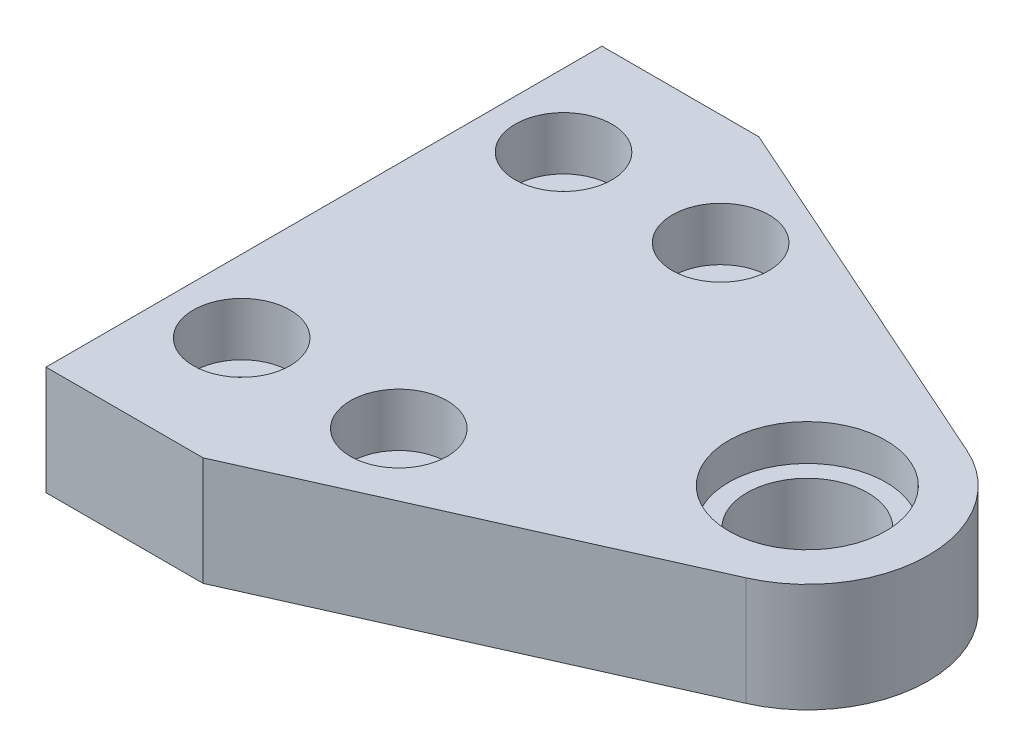
ISO-10303-21;
HEADER;
FILE_DESCRIPTION(('STEP AP214'),'2;1');
FILE_NAME('part.step','',(''),(''),'','','');
FILE_SCHEMA(('AUTOMOTIVE_DESIGN { 1 0 10303 214 1 1 1 1 }'));
ENDSEC;
DATA;
#1=APPLICATION_CONTEXT('core data for automotive mechanical design processes');
#2=APPLICATION_PROTOCOL_DEFINITION('international standard','automotive_design',2000,#1);
#3=PRODUCT_CONTEXT('',#1,'mechanical');
#4=PRODUCT('Part','Part','',(#3));
#5=PRODUCT_RELATED_PRODUCT_CATEGORY('part','',(#4));
#6=PRODUCT_DEFINITION_FORMATION('','',#4);
#7=PRODUCT_DEFINITION_CONTEXT('part definition',#1,'design');
#8=PRODUCT_DEFINITION('design','',#6,#7);
#9=PRODUCT_DEFINITION_SHAPE('','',#8);
#10=(LENGTH_UNIT() NAMED_UNIT(*) SI_UNIT(.MILLI.,.METRE.));
#11=(NAMED_UNIT(*) PLANE_ANGLE_UNIT() SI_UNIT($,.RADIAN.));
#12=(NAMED_UNIT(*) SI_UNIT($,.STERADIAN.) SOLID_ANGLE_UNIT());
#13=UNCERTAINTY_MEASURE_WITH_UNIT(LENGTH_MEASURE(1.E-05),#10,'distance_accuracy_value','');
#14=(GEOMETRIC_REPRESENTATION_CONTEXT(3) GLOBAL_UNCERTAINTY_ASSIGNED_CONTEXT((#13)) GLOBAL_UNIT_ASSIGNED_CONTEXT((#10,
#11,#12)) REPRESENTATION_CONTEXT('',''));
#15=CARTESIAN_POINT('',(0.,0.,0.));
#16=DIRECTION('',(0.,0.,1.));
#17=DIRECTION('',(1.,0.,0.));
#18=AXIS2_PLACEMENT_3D('',#15,#16,#17);
#19=CARTESIAN_POINT('',(40.,0.,0.));
#20=DIRECTION('',(0.,1.,0.));
#21=DIRECTION('',(0.,0.,1.));
#22=AXIS2_PLACEMENT_3D('',#19,#20,#21);
#23=PLANE('',#22);
#24=CARTESIAN_POINT('',(40.,0.,0.));
#25=DIRECTION('',(0.,1.,0.));
#26=DIRECTION('',(0.,0.,1.));
#27=AXIS2_PLACEMENT_3D('',#24,#25,#26);
#28=CIRCLE('',#27,5.);
#29=CARTESIAN_POINT('',(40.,0.,5.));
#30=VERTEX_POINT('',#29);
#31=EDGE_CURVE('E43',#30,#30,#28,.T.);
#32=ORIENTED_EDGE('',*,*,#31,.T.);
#33=EDGE_LOOP('',(#32));
#34=FACE_BOUND('',#33,.T.);
#35=CARTESIAN_POINT('',(6.,0.,-13.827116768124));
#36=DIRECTION('',(0.,1.,0.));
#37=DIRECTION('',(0.,0.,1.));
#38=AXIS2_PLACEMENT_3D('',#35,#36,#37);
#39=CIRCLE('',#38,2.25);
#40=CARTESIAN_POINT('',(6.,0.,-11.577116768124));
#41=VERTEX_POINT('',#40);
#42=EDGE_CURVE('E296',#41,#41,#39,.T.);
#43=ORIENTED_EDGE('',*,*,#42,.T.);
#44=EDGE_LOOP('',(#43));
#45=FACE_BOUND('',#44,.T.);
#46=CARTESIAN_POINT('',(19.,0.,-13.827116768124));
#47=DIRECTION('',(0.,1.,0.));
#48=DIRECTION('',(0.,0.,1.));
#49=AXIS2_PLACEMENT_3D('',#46,#47,#48);
#50=CIRCLE('',#49,2.25);
#51=CARTESIAN_POINT('',(19.,0.,-11.577116768124));
#52=VERTEX_POINT('',#51);
#53=EDGE_CURVE('E280',#52,#52,#50,.T.);
#54=ORIENTED_EDGE('',*,*,#53,.T.);
#55=EDGE_LOOP('',(#54));
#56=FACE_BOUND('',#55,.T.);
#57=CARTESIAN_POINT('',(6.,0.,12.807083563918));
#58=DIRECTION('',(0.,1.,0.));
#59=DIRECTION('',(0.,0.,1.));
#60=AXIS2_PLACEMENT_3D('',#57,#58,#59);
#61=CIRCLE('',#60,2.25);
#62=CARTESIAN_POINT('',(6.,0.,15.057083563918));
#63=VERTEX_POINT('',#62);
#64=EDGE_CURVE('E264',#63,#63,#61,.T.);
#65=ORIENTED_EDGE('',*,*,#64,.T.);
#66=EDGE_LOOP('',(#65));
#67=FACE_BOUND('',#66,.T.);
#68=CARTESIAN_POINT('',(19.,0.,12.807083563918));
#69=DIRECTION('',(0.,1.,0.));
#70=DIRECTION('',(0.,0.,1.));
#71=AXIS2_PLACEMENT_3D('',#68,#69,#70);
#72=CIRCLE('',#71,2.25);
#73=CARTESIAN_POINT('',(19.,0.,15.057083563918));
#74=VERTEX_POINT('',#73);
#75=EDGE_CURVE('E245',#74,#74,#72,.T.);
#76=ORIENTED_EDGE('',*,*,#75,.T.);
#77=EDGE_LOOP('',(#76));
#78=FACE_BOUND('',#77,.T.);
#79=DIRECTION('',(-1.,0.,0.));
#80=VECTOR('',#79,1.);
#81=CARTESIAN_POINT('',(0.,0.,5.));
#82=LINE('',#81,#80);
#83=CARTESIAN_POINT('',(24.,0.,5.));
#84=VERTEX_POINT('',#83);
#85=CARTESIAN_POINT('',(0.,0.,5.));
#86=VERTEX_POINT('',#85);
#87=EDGE_CURVE('E56',#84,#86,#82,.T.);
#88=ORIENTED_EDGE('',*,*,#87,.F.);
#89=DIRECTION('',(0.,0.,1.));
#90=VECTOR('',#89,1.);
#91=CARTESIAN_POINT('',(24.,0.,-5.));
#92=LINE('',#91,#90);
#93=CARTESIAN_POINT('',(24.,0.,-5.));
#94=VERTEX_POINT('',#93);
#95=EDGE_CURVE('E240',#94,#84,#92,.T.);
#96=ORIENTED_EDGE('',*,*,#95,.F.);
#97=DIRECTION('',(1.,0.,0.));
#98=VECTOR('',#97,1.);
#99=CARTESIAN_POINT('',(0.,0.,-5.));
#100=LINE('',#99,#98);
#101=CARTESIAN_POINT('',(0.,0.,-5.));
#102=VERTEX_POINT('',#101);
#103=EDGE_CURVE('E243',#102,#94,#100,.T.);
#104=ORIENTED_EDGE('',*,*,#103,.F.);
#105=DIRECTION('',(0.,0.,1.));
#106=VECTOR('',#105,1.);
#107=CARTESIAN_POINT('',(0.,0.,0.));
#108=LINE('',#107,#106);
#109=CARTESIAN_POINT('',(0.,0.,-23.));
#110=VERTEX_POINT('',#109);
#111=EDGE_CURVE('E143',#110,#102,#108,.T.);
#112=ORIENTED_EDGE('',*,*,#111,.F.);
#113=DIRECTION('',(-1.,0.,0.));
#114=VECTOR('',#113,1.);
#115=CARTESIAN_POINT('',(0.,0.,-23.));
#116=LINE('',#115,#114);
#117=CARTESIAN_POINT('',(13.,0.,-23.));
#118=VERTEX_POINT('',#117);
#119=EDGE_CURVE('E184',#118,#110,#116,.T.);
#120=ORIENTED_EDGE('',*,*,#119,.F.);
#121=DIRECTION('',(-0.91319059973559,0.,-0.407532733108095));
#122=VECTOR('',#121,1.);
#123=CARTESIAN_POINT('',(13.,0.,-23.));
#124=LINE('',#123,#122);
#125=CARTESIAN_POINT('',(44.0753273310809,0.,-9.1319059973559));
#126=VERTEX_POINT('',#125);
#127=EDGE_CURVE('E181',#126,#118,#124,.T.);
#128=ORIENTED_EDGE('',*,*,#127,.F.);
#129=CARTESIAN_POINT('',(40.,0.,0.));
#130=DIRECTION('',(0.,1.,0.));
#131=DIRECTION('',(0.,0.,1.));
#132=AXIS2_PLACEMENT_3D('',#129,#130,#131);
#133=CIRCLE('',#132,10.);
#134=CARTESIAN_POINT('',(44.0753273310809,0.,9.1319059973559));
#135=VERTEX_POINT('',#134);
#136=EDGE_CURVE('E178',#135,#126,#133,.T.);
#137=ORIENTED_EDGE('',*,*,#136,.F.);
#138=DIRECTION('',(0.91319059973559,0.,-0.407532733108095));
#139=VECTOR('',#138,1.);
#140=CARTESIAN_POINT('',(44.0753273310809,0.,9.1319059973559));
#141=LINE('',#140,#139);
#142=CARTESIAN_POINT('',(13.,0.,23.));
#143=VERTEX_POINT('',#142);
#144=EDGE_CURVE('E149',#143,#135,#141,.T.);
#145=ORIENTED_EDGE('',*,*,#144,.F.);
#146=DIRECTION('',(1.,0.,0.));
#147=VECTOR('',#146,1.);
#148=CARTESIAN_POINT('',(13.,0.,23.));
#149=LINE('',#148,#147);
#150=CARTESIAN_POINT('',(0.,0.,23.));
#151=VERTEX_POINT('',#150);
#152=EDGE_CURVE('E145',#151,#143,#149,.T.);
#153=ORIENTED_EDGE('',*,*,#152,.F.);
#154=EDGE_CURVE('E61',#86,#151,#108,.T.);
#155=ORIENTED_EDGE('',*,*,#154,.F.);
#156=EDGE_LOOP('',(#88,#96,#104,#112,#120,#128,#137,#145,#153,#155));
#157=FACE_BOUND('',#156,.T.);
#158=ADVANCED_FACE('F39',(#34,#45,#56,#67,#78,#157),#23,.F.);
#159=CARTESIAN_POINT('',(13.,9.,23.));
#160=DIRECTION('',(0.,0.,-1.));
#161=DIRECTION('',(-1.,0.,0.));
#162=AXIS2_PLACEMENT_3D('',#159,#160,#161);
#163=PLANE('',#162);
#164=ORIENTED_EDGE('',*,*,#152,.T.);
#165=DIRECTION('',(0.,-1.,0.));
#166=VECTOR('',#165,1.);
#167=CARTESIAN_POINT('',(13.,9.,23.));
#168=LINE('',#167,#166);
#169=CARTESIAN_POINT('',(13.,9.,23.));
#170=VERTEX_POINT('',#169);
#171=EDGE_CURVE('E49',#170,#143,#168,.T.);
#172=ORIENTED_EDGE('',*,*,#171,.F.);
#173=DIRECTION('',(1.,0.,0.));
#174=VECTOR('',#173,1.);
#175=CARTESIAN_POINT('',(13.,9.,23.));
#176=LINE('',#175,#174);
#177=CARTESIAN_POINT('',(0.,9.,23.));
#178=VERTEX_POINT('',#177);
#179=EDGE_CURVE('E159',#178,#170,#176,.T.);
#180=ORIENTED_EDGE('',*,*,#179,.F.);
#181=DIRECTION('',(0.,-1.,0.));
#182=VECTOR('',#181,1.);
#183=CARTESIAN_POINT('',(0.,9.,23.));
#184=LINE('',#183,#182);
#185=EDGE_CURVE('E11',#178,#151,#184,.T.);
#186=ORIENTED_EDGE('',*,*,#185,.T.);
#187=EDGE_LOOP('',(#164,#172,#180,#186));
#188=FACE_BOUND('',#187,.T.);
#189=ADVANCED_FACE('F41',(#188),#163,.F.);
#190=CARTESIAN_POINT('',(44.0753273310809,9.,9.1319059973559));
#191=DIRECTION('',(-0.407532733108095,0.,-0.91319059973559));
#192=DIRECTION('',(-0.91319059973559,0.,0.407532733108095));
#193=AXIS2_PLACEMENT_3D('',#190,#191,#192);
#194=PLANE('',#193);
#195=ORIENTED_EDGE('',*,*,#144,.T.);
#196=DIRECTION('',(0.,-1.,0.));
#197=VECTOR('',#196,1.);
#198=CARTESIAN_POINT('',(44.0753273310809,9.,9.1319059973559));
#199=LINE('',#198,#197);
#200=CARTESIAN_POINT('',(44.0753273310809,9.,9.1319059973559));
#201=VERTEX_POINT('',#200);
#202=EDGE_CURVE('E199',#201,#135,#199,.T.);
#203=ORIENTED_EDGE('',*,*,#202,.F.);
#204=DIRECTION('',(0.91319059973559,0.,-0.407532733108095));
#205=VECTOR('',#204,1.);
#206=CARTESIAN_POINT('',(44.0753273310809,9.,9.1319059973559));
#207=LINE('',#206,#205);
#208=EDGE_CURVE('E162',#170,#201,#207,.T.);
#209=ORIENTED_EDGE('',*,*,#208,.F.);
#210=ORIENTED_EDGE('',*,*,#171,.T.);
#211=EDGE_LOOP('',(#195,#203,#209,#210));
#212=FACE_BOUND('',#211,.T.);
#213=ADVANCED_FACE('F209',(#212),#194,.F.);
#214=CARTESIAN_POINT('',(40.,9.,0.));
#215=DIRECTION('',(0.,-1.,0.));
#216=DIRECTION('',(0.,0.,-1.));
#217=AXIS2_PLACEMENT_3D('',#214,#215,#216);
#218=CYLINDRICAL_SURFACE('',#217,10.);
#219=ORIENTED_EDGE('',*,*,#136,.T.);
#220=DIRECTION('',(0.,-1.,0.));
#221=VECTOR('',#220,1.);
#222=CARTESIAN_POINT('',(44.0753273310809,9.,-9.1319059973559));
#223=LINE('',#222,#221);
#224=CARTESIAN_POINT('',(44.0753273310809,9.,-9.1319059973559));
#225=VERTEX_POINT('',#224);
#226=EDGE_CURVE('E195',#225,#126,#223,.T.);
#227=ORIENTED_EDGE('',*,*,#226,.F.);
#228=CARTESIAN_POINT('',(40.,9.,0.));
#229=DIRECTION('',(0.,1.,0.));
#230=DIRECTION('',(0.,0.,1.));
#231=AXIS2_PLACEMENT_3D('',#228,#229,#230);
#232=CIRCLE('',#231,10.);
#233=EDGE_CURVE('E165',#201,#225,#232,.T.);
#234=ORIENTED_EDGE('',*,*,#233,.F.);
#235=ORIENTED_EDGE('',*,*,#202,.T.);
#236=EDGE_LOOP('',(#219,#227,#234,#235));
#237=FACE_BOUND('',#236,.T.);
#238=ADVANCED_FACE('F217',(#237),#218,.T.);
#239=CARTESIAN_POINT('',(13.,9.,-23.));
#240=DIRECTION('',(-0.407532733108095,0.,0.91319059973559));
#241=DIRECTION('',(0.91319059973559,0.,0.407532733108095));
#242=AXIS2_PLACEMENT_3D('',#239,#240,#241);
#243=PLANE('',#242);
#244=ORIENTED_EDGE('',*,*,#127,.T.);
#245=DIRECTION('',(0.,-1.,0.));
#246=VECTOR('',#245,1.);
#247=CARTESIAN_POINT('',(13.,9.,-23.));
#248=LINE('',#247,#246);
#249=CARTESIAN_POINT('',(13.,9.,-23.));
#250=VERTEX_POINT('',#249);
#251=EDGE_CURVE('E191',#250,#118,#248,.T.);
#252=ORIENTED_EDGE('',*,*,#251,.F.);
#253=DIRECTION('',(-0.91319059973559,0.,-0.407532733108095));
#254=VECTOR('',#253,1.);
#255=CARTESIAN_POINT('',(13.,9.,-23.));
#256=LINE('',#255,#254);
#257=EDGE_CURVE('E168',#225,#250,#256,.T.);
#258=ORIENTED_EDGE('',*,*,#257,.F.);
#259=ORIENTED_EDGE('',*,*,#226,.T.);
#260=EDGE_LOOP('',(#244,#252,#258,#259));
#261=FACE_BOUND('',#260,.T.);
#262=ADVANCED_FACE('F221',(#261),#243,.F.);
#263=CARTESIAN_POINT('',(0.,9.,-23.));
#264=DIRECTION('',(0.,0.,1.));
#265=DIRECTION('',(1.,0.,0.));
#266=AXIS2_PLACEMENT_3D('',#263,#264,#265);
#267=PLANE('',#266);
#268=ORIENTED_EDGE('',*,*,#119,.T.);
#269=DIRECTION('',(0.,-1.,0.));
#270=VECTOR('',#269,1.);
#271=CARTESIAN_POINT('',(0.,9.,-23.));
#272=LINE('',#271,#270);
#273=CARTESIAN_POINT('',(0.,9.,-23.));
#274=VERTEX_POINT('',#273);
#275=EDGE_CURVE('E174',#274,#110,#272,.T.);
#276=ORIENTED_EDGE('',*,*,#275,.F.);
#277=DIRECTION('',(-1.,0.,0.));
#278=VECTOR('',#277,1.);
#279=CARTESIAN_POINT('',(0.,9.,-23.));
#280=LINE('',#279,#278);
#281=EDGE_CURVE('E171',#250,#274,#280,.T.);
#282=ORIENTED_EDGE('',*,*,#281,.F.);
#283=ORIENTED_EDGE('',*,*,#251,.T.);
#284=EDGE_LOOP('',(#268,#276,#282,#283));
#285=FACE_BOUND('',#284,.T.);
#286=ADVANCED_FACE('F367',(#285),#267,.F.);
#287=CARTESIAN_POINT('',(0.,9.,0.));
#288=DIRECTION('',(1.,0.,0.));
#289=DIRECTION('',(0.,0.,-1.));
#290=AXIS2_PLACEMENT_3D('',#287,#288,#289);
#291=PLANE('',#290);
#292=ORIENTED_EDGE('',*,*,#111,.T.);
#293=DIRECTION('',(0.,1.,0.));
#294=VECTOR('',#293,1.);
#295=CARTESIAN_POINT('',(0.,-3.,-5.));
#296=LINE('',#295,#294);
#297=CARTESIAN_POINT('',(0.,-3.,-5.));
#298=VERTEX_POINT('',#297);
#299=EDGE_CURVE('E121',#298,#102,#296,.T.);
#300=ORIENTED_EDGE('',*,*,#299,.F.);
#301=DIRECTION('',(0.,0.,-1.));
#302=VECTOR('',#301,1.);
#303=CARTESIAN_POINT('',(0.,-3.,-5.));
#304=LINE('',#303,#302);
#305=CARTESIAN_POINT('',(0.,-3.,5.));
#306=VERTEX_POINT('',#305);
#307=EDGE_CURVE('E128',#306,#298,#304,.T.);
#308=ORIENTED_EDGE('',*,*,#307,.F.);
#309=DIRECTION('',(0.,1.,0.));
#310=VECTOR('',#309,1.);
#311=CARTESIAN_POINT('',(0.,-3.,5.));
#312=LINE('',#311,#310);
#313=EDGE_CURVE('E228',#306,#86,#312,.T.);
#314=ORIENTED_EDGE('',*,*,#313,.T.);
#315=ORIENTED_EDGE('',*,*,#154,.T.);
#316=ORIENTED_EDGE('',*,*,#185,.F.);
#317=DIRECTION('',(0.,0.,1.));
#318=VECTOR('',#317,1.);
#319=CARTESIAN_POINT('',(0.,9.,23.));
#320=LINE('',#319,#318);
#321=EDGE_CURVE('E155',#274,#178,#320,.T.);
#322=ORIENTED_EDGE('',*,*,#321,.F.);
#323=ORIENTED_EDGE('',*,*,#275,.T.);
#324=EDGE_LOOP('',(#292,#300,#308,#314,#315,#316,#322,#323));
#325=FACE_BOUND('',#324,.T.);
#326=ADVANCED_FACE('F140',(#325),#291,.F.);
#327=CARTESIAN_POINT('',(40.,9.,0.));
#328=DIRECTION('',(0.,1.,0.));
#329=DIRECTION('',(0.,0.,1.));
#330=AXIS2_PLACEMENT_3D('',#327,#328,#329);
#331=PLANE('',#330);
#332=CARTESIAN_POINT('',(40.,9.,0.));
#333=DIRECTION('',(0.,1.,0.));
#334=DIRECTION('',(0.,0.,1.));
#335=AXIS2_PLACEMENT_3D('',#332,#333,#334);
#336=CIRCLE('',#335,6.5);
#337=CARTESIAN_POINT('',(40.,9.,6.5));
#338=VERTEX_POINT('',#337);
#339=EDGE_CURVE('E320',#338,#338,#336,.T.);
#340=ORIENTED_EDGE('',*,*,#339,.F.);
#341=EDGE_LOOP('',(#340));
#342=FACE_BOUND('',#341,.T.);
#343=CARTESIAN_POINT('',(6.,9.,-13.827116768124));
#344=DIRECTION('',(0.,1.,0.));
#345=DIRECTION('',(0.,0.,1.));
#346=AXIS2_PLACEMENT_3D('',#343,#344,#345);
#347=CIRCLE('',#346,3.99999999999999);
#348=CARTESIAN_POINT('',(6.,9.,-9.827116768124));
#349=VERTEX_POINT('',#348);
#350=EDGE_CURVE('E308',#349,#349,#347,.T.);
#351=ORIENTED_EDGE('',*,*,#350,.F.);
#352=EDGE_LOOP('',(#351));
#353=FACE_BOUND('',#352,.T.);
#354=CARTESIAN_POINT('',(19.,9.,-13.827116768124));
#355=DIRECTION('',(0.,1.,0.));
#356=DIRECTION('',(0.,0.,1.));
#357=AXIS2_PLACEMENT_3D('',#354,#355,#356);
#358=CIRCLE('',#357,3.99999999999999);
#359=CARTESIAN_POINT('',(19.,9.,-9.827116768124));
#360=VERTEX_POINT('',#359);
#361=EDGE_CURVE('E292',#360,#360,#358,.T.);
#362=ORIENTED_EDGE('',*,*,#361,.F.);
#363=EDGE_LOOP('',(#362));
#364=FACE_BOUND('',#363,.T.);
#365=CARTESIAN_POINT('',(6.,9.,12.807083563918));
#366=DIRECTION('',(0.,1.,0.));
#367=DIRECTION('',(0.,0.,1.));
#368=AXIS2_PLACEMENT_3D('',#365,#366,#367);
#369=CIRCLE('',#368,3.99999999999999);
#370=CARTESIAN_POINT('',(6.,9.,16.807083563918));
#371=VERTEX_POINT('',#370);
#372=EDGE_CURVE('E276',#371,#371,#369,.T.);
#373=ORIENTED_EDGE('',*,*,#372,.F.);
#374=EDGE_LOOP('',(#373));
#375=FACE_BOUND('',#374,.T.);
#376=CARTESIAN_POINT('',(19.,9.,12.807083563918));
#377=DIRECTION('',(0.,1.,0.));
#378=DIRECTION('',(0.,0.,1.));
#379=AXIS2_PLACEMENT_3D('',#376,#377,#378);
#380=CIRCLE('',#379,3.99999999999999);
#381=CARTESIAN_POINT('',(19.,9.,16.807083563918));
#382=VERTEX_POINT('',#381);
#383=EDGE_CURVE('E260',#382,#382,#380,.T.);
#384=ORIENTED_EDGE('',*,*,#383,.F.);
#385=EDGE_LOOP('',(#384));
#386=FACE_BOUND('',#385,.T.);
#387=ORIENTED_EDGE('',*,*,#321,.T.);
#388=ORIENTED_EDGE('',*,*,#179,.T.);
#389=ORIENTED_EDGE('',*,*,#208,.T.);
#390=ORIENTED_EDGE('',*,*,#233,.T.);
#391=ORIENTED_EDGE('',*,*,#257,.T.);
#392=ORIENTED_EDGE('',*,*,#281,.T.);
#393=EDGE_LOOP('',(#387,#388,#389,#390,#391,#392));
#394=FACE_BOUND('',#393,.T.);
#395=ADVANCED_FACE('F225',(#342,#353,#364,#375,#386,#394),#331,.T.);
#396=CARTESIAN_POINT('',(0.,-3.,-5.));
#397=DIRECTION('',(0.,0.,1.));
#398=DIRECTION('',(1.,0.,0.));
#399=AXIS2_PLACEMENT_3D('',#396,#397,#398);
#400=PLANE('',#399);
#401=ORIENTED_EDGE('',*,*,#103,.T.);
#402=DIRECTION('',(0.,1.,0.));
#403=VECTOR('',#402,1.);
#404=CARTESIAN_POINT('',(24.,-3.,-5.));
#405=LINE('',#404,#403);
#406=CARTESIAN_POINT('',(24.,-3.,-5.));
#407=VERTEX_POINT('',#406);
#408=EDGE_CURVE('E123',#407,#94,#405,.T.);
#409=ORIENTED_EDGE('',*,*,#408,.F.);
#410=DIRECTION('',(1.,0.,0.));
#411=VECTOR('',#410,1.);
#412=CARTESIAN_POINT('',(0.,-3.,-5.));
#413=LINE('',#412,#411);
#414=EDGE_CURVE('E116',#298,#407,#413,.T.);
#415=ORIENTED_EDGE('',*,*,#414,.F.);
#416=ORIENTED_EDGE('',*,*,#299,.T.);
#417=EDGE_LOOP('',(#401,#409,#415,#416));
#418=FACE_BOUND('',#417,.T.);
#419=ADVANCED_FACE('F119',(#418),#400,.F.);
#420=CARTESIAN_POINT('',(24.,-3.,-5.));
#421=DIRECTION('',(-1.,0.,0.));
#422=DIRECTION('',(0.,0.,1.));
#423=AXIS2_PLACEMENT_3D('',#420,#421,#422);
#424=PLANE('',#423);
#425=ORIENTED_EDGE('',*,*,#95,.T.);
#426=DIRECTION('',(0.,1.,0.));
#427=VECTOR('',#426,1.);
#428=CARTESIAN_POINT('',(24.,-3.,5.));
#429=LINE('',#428,#427);
#430=CARTESIAN_POINT('',(24.,-3.,5.));
#431=VERTEX_POINT('',#430);
#432=EDGE_CURVE('E151',#431,#84,#429,.T.);
#433=ORIENTED_EDGE('',*,*,#432,.F.);
#434=DIRECTION('',(0.,0.,1.));
#435=VECTOR('',#434,1.);
#436=CARTESIAN_POINT('',(24.,-3.,-5.));
#437=LINE('',#436,#435);
#438=EDGE_CURVE('E127',#407,#431,#437,.T.);
#439=ORIENTED_EDGE('',*,*,#438,.F.);
#440=ORIENTED_EDGE('',*,*,#408,.T.);
#441=EDGE_LOOP('',(#425,#433,#439,#440));
#442=FACE_BOUND('',#441,.T.);
#443=ADVANCED_FACE('F406',(#442),#424,.F.);
#444=CARTESIAN_POINT('',(0.,-3.,5.));
#445=DIRECTION('',(0.,0.,-1.));
#446=DIRECTION('',(-1.,0.,0.));
#447=AXIS2_PLACEMENT_3D('',#444,#445,#446);
#448=PLANE('',#447);
#449=ORIENTED_EDGE('',*,*,#87,.T.);
#450=ORIENTED_EDGE('',*,*,#313,.F.);
#451=DIRECTION('',(-1.,0.,0.));
#452=VECTOR('',#451,1.);
#453=CARTESIAN_POINT('',(0.,-3.,5.));
#454=LINE('',#453,#452);
#455=EDGE_CURVE('E133',#431,#306,#454,.T.);
#456=ORIENTED_EDGE('',*,*,#455,.F.);
#457=ORIENTED_EDGE('',*,*,#432,.T.);
#458=EDGE_LOOP('',(#449,#450,#456,#457));
#459=FACE_BOUND('',#458,.T.);
#460=ADVANCED_FACE('F412',(#459),#448,.F.);
#461=CARTESIAN_POINT('',(0.,-3.,0.));
#462=DIRECTION('',(0.,1.,0.));
#463=DIRECTION('',(0.,0.,1.));
#464=AXIS2_PLACEMENT_3D('',#461,#462,#463);
#465=PLANE('',#464);
#466=ORIENTED_EDGE('',*,*,#307,.T.);
#467=ORIENTED_EDGE('',*,*,#414,.T.);
#468=ORIENTED_EDGE('',*,*,#438,.T.);
#469=ORIENTED_EDGE('',*,*,#455,.T.);
#470=EDGE_LOOP('',(#466,#467,#468,#469));
#471=FACE_BOUND('',#470,.T.);
#472=ADVANCED_FACE('F131',(#471),#465,.F.);
#473=CARTESIAN_POINT('',(19.,9.,12.807083563918));
#474=DIRECTION('',(0.,1.,0.));
#475=DIRECTION('',(0.,0.,1.));
#476=AXIS2_PLACEMENT_3D('',#473,#474,#475);
#477=CYLINDRICAL_SURFACE('',#476,2.25);
#478=ORIENTED_EDGE('',*,*,#75,.F.);
#479=EDGE_LOOP('',(#478));
#480=FACE_BOUND('',#479,.T.);
#481=CARTESIAN_POINT('',(19.,4.6,12.807083563918));
#482=DIRECTION('',(0.,1.,0.));
#483=DIRECTION('',(0.,0.,1.));
#484=AXIS2_PLACEMENT_3D('',#481,#482,#483);
#485=CIRCLE('',#484,2.25);
#486=CARTESIAN_POINT('',(19.,4.6,15.057083563918));
#487=VERTEX_POINT('',#486);
#488=EDGE_CURVE('E252',#487,#487,#485,.T.);
#489=ORIENTED_EDGE('',*,*,#488,.T.);
#490=EDGE_LOOP('',(#489));
#491=FACE_BOUND('',#490,.T.);
#492=ADVANCED_FACE('F351',(#480,#491),#477,.F.);
#493=CARTESIAN_POINT('',(21.25,4.6,12.807083563918));
#494=DIRECTION('',(0.,-1.,0.));
#495=DIRECTION('',(0.,0.,-1.));
#496=AXIS2_PLACEMENT_3D('',#493,#494,#495);
#497=PLANE('',#496);
#498=ORIENTED_EDGE('',*,*,#488,.F.);
#499=EDGE_LOOP('',(#498));
#500=FACE_BOUND('',#499,.T.);
#501=CARTESIAN_POINT('',(19.,4.6,12.807083563918));
#502=DIRECTION('',(0.,1.,0.));
#503=DIRECTION('',(0.,0.,1.));
#504=AXIS2_PLACEMENT_3D('',#501,#502,#503);
#505=CIRCLE('',#504,3.99999999999999);
#506=CARTESIAN_POINT('',(19.,4.6,16.807083563918));
#507=VERTEX_POINT('',#506);
#508=EDGE_CURVE('E256',#507,#507,#505,.T.);
#509=ORIENTED_EDGE('',*,*,#508,.T.);
#510=EDGE_LOOP('',(#509));
#511=FACE_BOUND('',#510,.T.);
#512=ADVANCED_FACE('F341',(#500,#511),#497,.F.);
#513=CARTESIAN_POINT('',(19.,9.,12.807083563918));
#514=DIRECTION('',(0.,1.,0.));
#515=DIRECTION('',(0.,0.,1.));
#516=AXIS2_PLACEMENT_3D('',#513,#514,#515);
#517=CYLINDRICAL_SURFACE('',#516,3.99999999999999);
#518=ORIENTED_EDGE('',*,*,#508,.F.);
#519=EDGE_LOOP('',(#518));
#520=FACE_BOUND('',#519,.T.);
#521=ORIENTED_EDGE('',*,*,#383,.T.);
#522=EDGE_LOOP('',(#521));
#523=FACE_BOUND('',#522,.T.);
#524=ADVANCED_FACE('F338',(#520,#523),#517,.F.);
#525=CARTESIAN_POINT('',(6.,9.,12.807083563918));
#526=DIRECTION('',(0.,1.,0.));
#527=DIRECTION('',(0.,0.,1.));
#528=AXIS2_PLACEMENT_3D('',#525,#526,#527);
#529=CYLINDRICAL_SURFACE('',#528,2.25);
#530=ORIENTED_EDGE('',*,*,#64,.F.);
#531=EDGE_LOOP('',(#530));
#532=FACE_BOUND('',#531,.T.);
#533=CARTESIAN_POINT('',(6.,4.6,12.807083563918));
#534=DIRECTION('',(0.,1.,0.));
#535=DIRECTION('',(0.,0.,1.));
#536=AXIS2_PLACEMENT_3D('',#533,#534,#535);
#537=CIRCLE('',#536,2.25);
#538=CARTESIAN_POINT('',(6.,4.6,15.057083563918));
#539=VERTEX_POINT('',#538);
#540=EDGE_CURVE('E268',#539,#539,#537,.T.);
#541=ORIENTED_EDGE('',*,*,#540,.T.);
#542=EDGE_LOOP('',(#541));
#543=FACE_BOUND('',#542,.T.);
#544=ADVANCED_FACE('F340',(#532,#543),#529,.F.);
#545=CARTESIAN_POINT('',(8.25,4.6,12.807083563918));
#546=DIRECTION('',(0.,-1.,0.));
#547=DIRECTION('',(0.,0.,-1.));
#548=AXIS2_PLACEMENT_3D('',#545,#546,#547);
#549=PLANE('',#548);
#550=ORIENTED_EDGE('',*,*,#540,.F.);
#551=EDGE_LOOP('',(#550));
#552=FACE_BOUND('',#551,.T.);
#553=CARTESIAN_POINT('',(6.,4.6,12.807083563918));
#554=DIRECTION('',(0.,1.,0.));
#555=DIRECTION('',(0.,0.,1.));
#556=AXIS2_PLACEMENT_3D('',#553,#554,#555);
#557=CIRCLE('',#556,3.99999999999999);
#558=CARTESIAN_POINT('',(6.,4.6,16.807083563918));
#559=VERTEX_POINT('',#558);
#560=EDGE_CURVE('E272',#559,#559,#557,.T.);
#561=ORIENTED_EDGE('',*,*,#560,.T.);
#562=EDGE_LOOP('',(#561));
#563=FACE_BOUND('',#562,.T.);
#564=ADVANCED_FACE('F348',(#552,#563),#549,.F.);
#565=CARTESIAN_POINT('',(6.,9.,12.807083563918));
#566=DIRECTION('',(0.,1.,0.));
#567=DIRECTION('',(0.,0.,1.));
#568=AXIS2_PLACEMENT_3D('',#565,#566,#567);
#569=CYLINDRICAL_SURFACE('',#568,3.99999999999999);
#570=ORIENTED_EDGE('',*,*,#560,.F.);
#571=EDGE_LOOP('',(#570));
#572=FACE_BOUND('',#571,.T.);
#573=ORIENTED_EDGE('',*,*,#372,.T.);
#574=EDGE_LOOP('',(#573));
#575=FACE_BOUND('',#574,.T.);
#576=ADVANCED_FACE('F456',(#572,#575),#569,.F.);
#577=CARTESIAN_POINT('',(19.,9.,-13.827116768124));
#578=DIRECTION('',(0.,1.,0.));
#579=DIRECTION('',(0.,0.,1.));
#580=AXIS2_PLACEMENT_3D('',#577,#578,#579);
#581=CYLINDRICAL_SURFACE('',#580,2.25);
#582=ORIENTED_EDGE('',*,*,#53,.F.);
#583=EDGE_LOOP('',(#582));
#584=FACE_BOUND('',#583,.T.);
#585=CARTESIAN_POINT('',(19.,4.6,-13.827116768124));
#586=DIRECTION('',(0.,1.,0.));
#587=DIRECTION('',(0.,0.,1.));
#588=AXIS2_PLACEMENT_3D('',#585,#586,#587);
#589=CIRCLE('',#588,2.25);
#590=CARTESIAN_POINT('',(19.,4.6,-11.577116768124));
#591=VERTEX_POINT('',#590);
#592=EDGE_CURVE('E284',#591,#591,#589,.T.);
#593=ORIENTED_EDGE('',*,*,#592,.T.);
#594=EDGE_LOOP('',(#593));
#595=FACE_BOUND('',#594,.T.);
#596=ADVANCED_FACE('F466',(#584,#595),#581,.F.);
#597=CARTESIAN_POINT('',(21.25,4.6,-13.827116768124));
#598=DIRECTION('',(0.,-1.,0.));
#599=DIRECTION('',(0.,0.,-1.));
#600=AXIS2_PLACEMENT_3D('',#597,#598,#599);
#601=PLANE('',#600);
#602=ORIENTED_EDGE('',*,*,#592,.F.);
#603=EDGE_LOOP('',(#602));
#604=FACE_BOUND('',#603,.T.);
#605=CARTESIAN_POINT('',(19.,4.6,-13.827116768124));
#606=DIRECTION('',(0.,1.,0.));
#607=DIRECTION('',(0.,0.,1.));
#608=AXIS2_PLACEMENT_3D('',#605,#606,#607);
#609=CIRCLE('',#608,3.99999999999999);
#610=CARTESIAN_POINT('',(19.,4.6,-9.827116768124));
#611=VERTEX_POINT('',#610);
#612=EDGE_CURVE('E288',#611,#611,#609,.T.);
#613=ORIENTED_EDGE('',*,*,#612,.T.);
#614=EDGE_LOOP('',(#613));
#615=FACE_BOUND('',#614,.T.);
#616=ADVANCED_FACE('F476',(#604,#615),#601,.F.);
#617=CARTESIAN_POINT('',(19.,9.,-13.827116768124));
#618=DIRECTION('',(0.,1.,0.));
#619=DIRECTION('',(0.,0.,1.));
#620=AXIS2_PLACEMENT_3D('',#617,#618,#619);
#621=CYLINDRICAL_SURFACE('',#620,3.99999999999999);
#622=ORIENTED_EDGE('',*,*,#612,.F.);
#623=EDGE_LOOP('',(#622));
#624=FACE_BOUND('',#623,.T.);
#625=ORIENTED_EDGE('',*,*,#361,.T.);
#626=EDGE_LOOP('',(#625));
#627=FACE_BOUND('',#626,.T.);
#628=ADVANCED_FACE('F486',(#624,#627),#621,.F.);
#629=CARTESIAN_POINT('',(6.,9.,-13.827116768124));
#630=DIRECTION('',(0.,1.,0.));
#631=DIRECTION('',(0.,0.,1.));
#632=AXIS2_PLACEMENT_3D('',#629,#630,#631);
#633=CYLINDRICAL_SURFACE('',#632,2.25);
#634=ORIENTED_EDGE('',*,*,#42,.F.);
#635=EDGE_LOOP('',(#634));
#636=FACE_BOUND('',#635,.T.);
#637=CARTESIAN_POINT('',(6.,4.6,-13.827116768124));
#638=DIRECTION('',(0.,1.,0.));
#639=DIRECTION('',(0.,0.,1.));
#640=AXIS2_PLACEMENT_3D('',#637,#638,#639);
#641=CIRCLE('',#640,2.25);
#642=CARTESIAN_POINT('',(6.,4.6,-11.577116768124));
#643=VERTEX_POINT('',#642);
#644=EDGE_CURVE('E300',#643,#643,#641,.T.);
#645=ORIENTED_EDGE('',*,*,#644,.T.);
#646=EDGE_LOOP('',(#645));
#647=FACE_BOUND('',#646,.T.);
#648=ADVANCED_FACE('F496',(#636,#647),#633,.F.);
#649=CARTESIAN_POINT('',(8.25,4.6,-13.827116768124));
#650=DIRECTION('',(0.,-1.,0.));
#651=DIRECTION('',(0.,0.,-1.));
#652=AXIS2_PLACEMENT_3D('',#649,#650,#651);
#653=PLANE('',#652);
#654=ORIENTED_EDGE('',*,*,#644,.F.);
#655=EDGE_LOOP('',(#654));
#656=FACE_BOUND('',#655,.T.);
#657=CARTESIAN_POINT('',(6.,4.6,-13.827116768124));
#658=DIRECTION('',(0.,1.,0.));
#659=DIRECTION('',(0.,0.,1.));
#660=AXIS2_PLACEMENT_3D('',#657,#658,#659);
#661=CIRCLE('',#660,3.99999999999999);
#662=CARTESIAN_POINT('',(6.,4.6,-9.827116768124));
#663=VERTEX_POINT('',#662);
#664=EDGE_CURVE('E304',#663,#663,#661,.T.);
#665=ORIENTED_EDGE('',*,*,#664,.T.);
#666=EDGE_LOOP('',(#665));
#667=FACE_BOUND('',#666,.T.);
#668=ADVANCED_FACE('F506',(#656,#667),#653,.F.);
#669=CARTESIAN_POINT('',(6.,9.,-13.827116768124));
#670=DIRECTION('',(0.,1.,0.));
#671=DIRECTION('',(0.,0.,1.));
#672=AXIS2_PLACEMENT_3D('',#669,#670,#671);
#673=CYLINDRICAL_SURFACE('',#672,3.99999999999999);
#674=ORIENTED_EDGE('',*,*,#664,.F.);
#675=EDGE_LOOP('',(#674));
#676=FACE_BOUND('',#675,.T.);
#677=ORIENTED_EDGE('',*,*,#350,.T.);
#678=EDGE_LOOP('',(#677));
#679=FACE_BOUND('',#678,.T.);
#680=ADVANCED_FACE('F516',(#676,#679),#673,.F.);
#681=CARTESIAN_POINT('',(40.,9.,0.));
#682=DIRECTION('',(0.,1.,0.));
#683=DIRECTION('',(0.,0.,1.));
#684=AXIS2_PLACEMENT_3D('',#681,#682,#683);
#685=CYLINDRICAL_SURFACE('',#684,5.);
#686=CARTESIAN_POINT('',(40.,6.,0.));
#687=DIRECTION('',(0.,1.,0.));
#688=DIRECTION('',(0.,0.,1.));
#689=AXIS2_PLACEMENT_3D('',#686,#687,#688);
#690=CIRCLE('',#689,5.);
#691=CARTESIAN_POINT('',(40.,6.,5.));
#692=VERTEX_POINT('',#691);
#693=EDGE_CURVE('E312',#692,#692,#690,.T.);
#694=ORIENTED_EDGE('',*,*,#693,.T.);
#695=EDGE_LOOP('',(#694));
#696=FACE_BOUND('',#695,.T.);
#697=ORIENTED_EDGE('',*,*,#31,.F.);
#698=EDGE_LOOP('',(#697));
#699=FACE_BOUND('',#698,.T.);
#700=ADVANCED_FACE('F525',(#696,#699),#685,.F.);
#701=CARTESIAN_POINT('',(45.,6.,0.));
#702=DIRECTION('',(0.,-1.,0.));
#703=DIRECTION('',(0.,0.,-1.));
#704=AXIS2_PLACEMENT_3D('',#701,#702,#703);
#705=PLANE('',#704);
#706=ORIENTED_EDGE('',*,*,#693,.F.);
#707=EDGE_LOOP('',(#706));
#708=FACE_BOUND('',#707,.T.);
#709=CARTESIAN_POINT('',(40.,6.,0.));
#710=DIRECTION('',(0.,1.,0.));
#711=DIRECTION('',(0.,0.,1.));
#712=AXIS2_PLACEMENT_3D('',#709,#710,#711);
#713=CIRCLE('',#712,6.5);
#714=CARTESIAN_POINT('',(40.,6.,6.5));
#715=VERTEX_POINT('',#714);
#716=EDGE_CURVE('E316',#715,#715,#713,.T.);
#717=ORIENTED_EDGE('',*,*,#716,.T.);
#718=EDGE_LOOP('',(#717));
#719=FACE_BOUND('',#718,.T.);
#720=ADVANCED_FACE('F571',(#708,#719),#705,.F.);
#721=CARTESIAN_POINT('',(40.,9.,0.));
#722=DIRECTION('',(0.,1.,0.));
#723=DIRECTION('',(0.,0.,1.));
#724=AXIS2_PLACEMENT_3D('',#721,#722,#723);
#725=CYLINDRICAL_SURFACE('',#724,6.5);
#726=ORIENTED_EDGE('',*,*,#716,.F.);
#727=EDGE_LOOP('',(#726));
#728=FACE_BOUND('',#727,.T.);
#729=ORIENTED_EDGE('',*,*,#339,.T.);
#730=EDGE_LOOP('',(#729));
#731=FACE_BOUND('',#730,.T.);
#732=ADVANCED_FACE('F325',(#728,#731),#725,.F.);
#733=CLOSED_SHELL('',(#158,#189,#213,#238,#262,#286,#326,#395,#419,#443,#460,#472,#492,#512,
#524,#544,#564,#576,#596,#616,#628,#648,#668,#680,#700,#720,#732));
#734=MANIFOLD_SOLID_BREP('B2',#733);
#735=ADVANCED_BREP_SHAPE_REPRESENTATION('',(#18,#734),#14);
#736=SHAPE_DEFINITION_REPRESENTATION(#9,#735);
ENDSEC;
END-ISO-10303-21;
